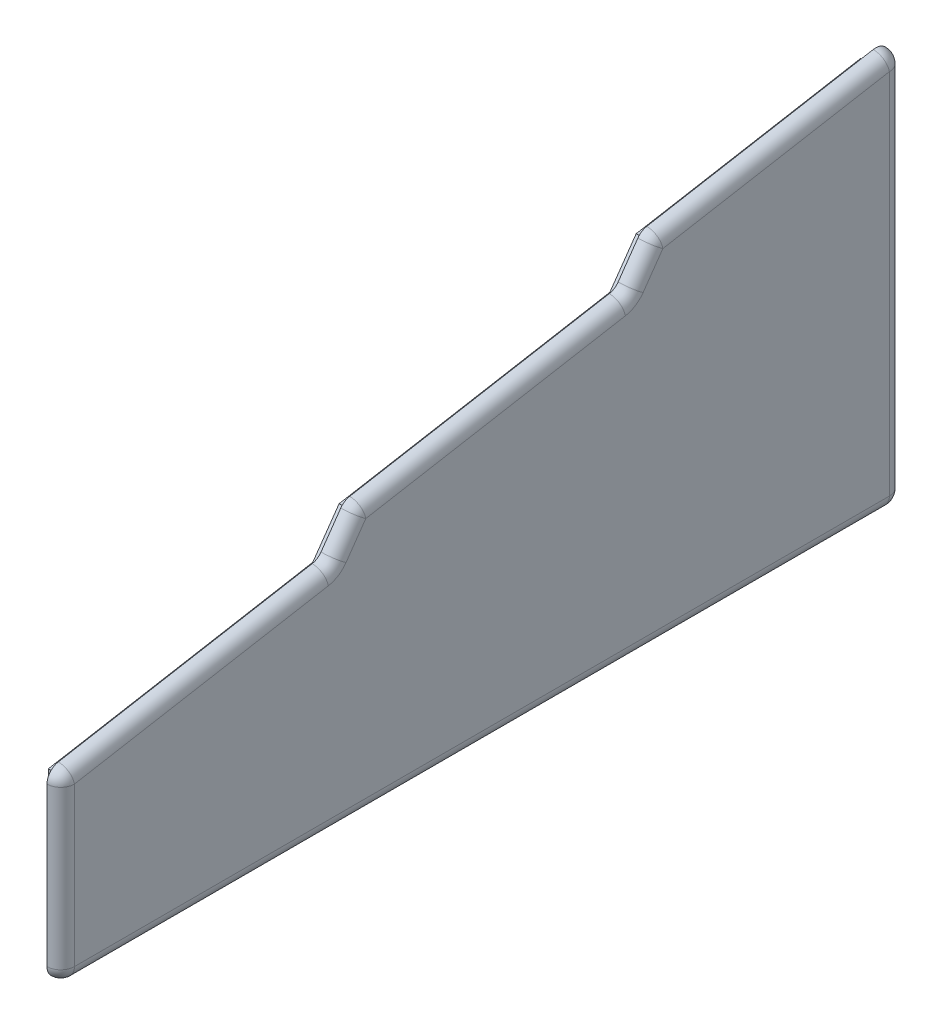
ISO-10303-21;
HEADER;
FILE_DESCRIPTION(('STEP AP214'),'2;1');
FILE_NAME('part.step','',(''),(''),'','','');
FILE_SCHEMA(('AUTOMOTIVE_DESIGN { 1 0 10303 214 1 1 1 1 }'));
ENDSEC;
DATA;
#1=APPLICATION_CONTEXT('core data for automotive mechanical design processes');
#2=APPLICATION_PROTOCOL_DEFINITION('international standard','automotive_design',2000,#1);
#3=PRODUCT_CONTEXT('',#1,'mechanical');
#4=PRODUCT('Part','Part','',(#3));
#5=PRODUCT_RELATED_PRODUCT_CATEGORY('part','',(#4));
#6=PRODUCT_DEFINITION_FORMATION('','',#4);
#7=PRODUCT_DEFINITION_CONTEXT('part definition',#1,'design');
#8=PRODUCT_DEFINITION('design','',#6,#7);
#9=PRODUCT_DEFINITION_SHAPE('','',#8);
#10=(LENGTH_UNIT() NAMED_UNIT(*) SI_UNIT(.MILLI.,.METRE.));
#11=(NAMED_UNIT(*) PLANE_ANGLE_UNIT() SI_UNIT($,.RADIAN.));
#12=(NAMED_UNIT(*) SI_UNIT($,.STERADIAN.) SOLID_ANGLE_UNIT());
#13=UNCERTAINTY_MEASURE_WITH_UNIT(LENGTH_MEASURE(1.E-05),#10,'distance_accuracy_value','');
#14=(GEOMETRIC_REPRESENTATION_CONTEXT(3) GLOBAL_UNCERTAINTY_ASSIGNED_CONTEXT((#13)) GLOBAL_UNIT_ASSIGNED_CONTEXT((#10,
#11,#12)) REPRESENTATION_CONTEXT('',''));
#15=CARTESIAN_POINT('',(0.,0.,0.));
#16=DIRECTION('',(0.,0.,1.));
#17=DIRECTION('',(1.,0.,0.));
#18=AXIS2_PLACEMENT_3D('',#15,#16,#17);
#19=CARTESIAN_POINT('',(-373.423184310713,0.,0.));
#20=DIRECTION('',(-1.,0.,0.));
#21=DIRECTION('',(0.,0.,-1.));
#22=AXIS2_PLACEMENT_3D('',#19,#20,#21);
#23=PLANE('',#22);
#24=DIRECTION('',(0.,0.,-1.));
#25=VECTOR('',#24,1.);
#26=CARTESIAN_POINT('',(-373.423184310713,-10.7880097999776,0.));
#27=LINE('',#26,#25);
#28=CARTESIAN_POINT('',(-373.423184310713,-10.7880097999776,139.976426469536));
#29=VERTEX_POINT('',#28);
#30=CARTESIAN_POINT('',(-373.423184310713,-10.7880097999776,-22.9293194874225));
#31=VERTEX_POINT('',#30);
#32=EDGE_CURVE('E262',#29,#31,#27,.T.);
#33=ORIENTED_EDGE('',*,*,#32,.F.);
#34=DIRECTION('',(0.,-1.,0.));
#35=VECTOR('',#34,1.);
#36=CARTESIAN_POINT('',(-373.423184310713,13.4732113382659,139.976426469536));
#37=LINE('',#36,#35);
#38=CARTESIAN_POINT('',(-373.423184310713,6.08268449513496,139.976426469536));
#39=VERTEX_POINT('',#38);
#40=EDGE_CURVE('E251',#39,#29,#37,.T.);
#41=ORIENTED_EDGE('',*,*,#40,.F.);
#42=DIRECTION('',(0.,-0.707106781186542,-0.707106781186553));
#43=VECTOR('',#42,1.);
#44=CARTESIAN_POINT('',(-373.423184310713,-66.9468709872003,66.9468709871994));
#45=LINE('',#44,#43);
#46=CARTESIAN_POINT('',(-373.423184310713,13.2362542687344,147.129996243135));
#47=VERTEX_POINT('',#46);
#48=EDGE_CURVE('E258',#47,#39,#45,.T.);
#49=ORIENTED_EDGE('',*,*,#48,.F.);
#50=DIRECTION('',(0.,-1.,0.));
#51=VECTOR('',#50,1.);
#52=CARTESIAN_POINT('',(-373.423184310713,0.,147.129996243135));
#53=LINE('',#52,#51);
#54=CARTESIAN_POINT('',(-373.423184310713,23.1429614171373,147.129996243135));
#55=VERTEX_POINT('',#54);
#56=EDGE_CURVE('E288',#55,#47,#53,.T.);
#57=ORIENTED_EDGE('',*,*,#56,.F.);
#58=DIRECTION('',(0.,-0.173648177666931,0.984807753012208));
#59=VECTOR('',#58,1.);
#60=CARTESIAN_POINT('',(-373.423184310713,47.6058269432683,8.39419172903622));
#61=LINE('',#60,#59);
#62=CARTESIAN_POINT('',(-373.423184310713,33.3183757949922,89.4223536749301));
#63=VERTEX_POINT('',#62);
#64=EDGE_CURVE('E284',#63,#55,#61,.T.);
#65=ORIENTED_EDGE('',*,*,#64,.F.);
#66=DIRECTION('',(0.,-0.819152044288993,0.573576436351044));
#67=VECTOR('',#66,1.);
#68=CARTESIAN_POINT('',(-373.423184310713,52.9761730059248,75.6578158832374));
#69=LINE('',#68,#67);
#70=CARTESIAN_POINT('',(-373.423184310713,41.5098962378821,83.6865893114197));
#71=VERTEX_POINT('',#70);
#72=EDGE_CURVE('E281',#71,#63,#69,.T.);
#73=ORIENTED_EDGE('',*,*,#72,.F.);
#74=DIRECTION('',(0.,-0.173648177666931,0.984807753012208));
#75=VECTOR('',#74,1.);
#76=CARTESIAN_POINT('',(-373.423184310713,54.5694693464685,9.62206976872595));
#77=LINE('',#76,#75);
#78=CARTESIAN_POINT('',(-373.423184310713,51.928786897898,24.5981241306872));
#79=VERTEX_POINT('',#78);
#80=EDGE_CURVE('E277',#79,#71,#77,.T.);
#81=ORIENTED_EDGE('',*,*,#80,.F.);
#82=DIRECTION('',(0.,-0.819152044288993,0.573576436351044));
#83=VECTOR('',#82,1.);
#84=CARTESIAN_POINT('',(-373.423184310713,28.6413857455665,40.9041379628631));
#85=LINE('',#84,#83);
#86=CARTESIAN_POINT('',(-373.423184310713,60.120307340788,18.8623597671767));
#87=VERTEX_POINT('',#86);
#88=EDGE_CURVE('E274',#87,#79,#85,.T.);
#89=ORIENTED_EDGE('',*,*,#88,.F.);
#90=DIRECTION('',(0.,-0.173648177666931,0.984807753012208));
#91=VECTOR('',#90,1.);
#92=CARTESIAN_POINT('',(-373.423184310713,61.5331117496687,10.8499478084157));
#93=LINE('',#92,#91);
#94=CARTESIAN_POINT('',(-373.423184310713,68.7506753219542,-30.082889261022));
#95=VERTEX_POINT('',#94);
#96=EDGE_CURVE('E271',#95,#87,#93,.T.);
#97=ORIENTED_EDGE('',*,*,#96,.F.);
#98=DIRECTION('',(0.,1.,0.));
#99=VECTOR('',#98,1.);
#100=CARTESIAN_POINT('',(-373.423184310713,0.,-30.082889261022));
#101=LINE('',#100,#99);
#102=CARTESIAN_POINT('',(-373.423184310713,13.2362542687345,-30.082889261022));
#103=VERTEX_POINT('',#102);
#104=EDGE_CURVE('E268',#103,#95,#101,.T.);
#105=ORIENTED_EDGE('',*,*,#104,.F.);
#106=DIRECTION('',(0.,0.707106781186551,-0.707106781186544));
#107=VECTOR('',#106,1.);
#108=CARTESIAN_POINT('',(-373.423184310713,-8.42331749614381,-8.42331749614389));
#109=LINE('',#108,#107);
#110=CARTESIAN_POINT('',(-373.423184310713,6.08268449513488,-22.9293194874225));
#111=VERTEX_POINT('',#110);
#112=EDGE_CURVE('E266',#111,#103,#109,.T.);
#113=ORIENTED_EDGE('',*,*,#112,.F.);
#114=DIRECTION('',(0.,-1.,0.));
#115=VECTOR('',#114,1.);
#116=CARTESIAN_POINT('',(-373.423184310713,13.4732113382659,-22.9293194874225));
#117=LINE('',#116,#115);
#118=EDGE_CURVE('E229',#111,#31,#117,.T.);
#119=ORIENTED_EDGE('',*,*,#118,.T.);
#120=EDGE_LOOP('',(#33,#41,#49,#57,#65,#73,#81,#89,#97,#105,#113,#119));
#121=FACE_BOUND('',#120,.T.);
#122=ADVANCED_FACE('F41',(#121),#23,.T.);
#123=CARTESIAN_POINT('',(-370.423184310713,69.1082013997325,-30.382889261022));
#124=DIRECTION('',(1.,0.,0.));
#125=DIRECTION('',(0.,0.,1.));
#126=AXIS2_PLACEMENT_3D('',#123,#124,#125);
#127=PLANE('',#126);
#128=CARTESIAN_POINT('',(-370.423184310713,-11.0880097999776,147.429996243135));
#129=DIRECTION('',(-1.,0.,0.));
#130=DIRECTION('',(0.,0.,1.));
#131=AXIS2_PLACEMENT_3D('',#128,#129,#130);
#132=CIRCLE('',#131,3.);
#133=CARTESIAN_POINT('',(-370.423184310713,-14.0880097999776,147.429996243135));
#134=VERTEX_POINT('',#133);
#135=CARTESIAN_POINT('',(-370.423184310713,-11.0880097999776,150.429996243135));
#136=VERTEX_POINT('',#135);
#137=EDGE_CURVE('E349',#134,#136,#132,.T.);
#138=ORIENTED_EDGE('',*,*,#137,.T.);
#139=DIRECTION('',(0.,1.,0.));
#140=VECTOR('',#139,1.);
#141=CARTESIAN_POINT('',(-370.423184310713,-4.08800979997756,150.429996243135));
#142=LINE('',#141,#140);
#143=CARTESIAN_POINT('',(-370.423184310713,23.3946913064905,150.429996243135));
#144=VERTEX_POINT('',#143);
#145=EDGE_CURVE('E352',#136,#144,#142,.T.);
#146=ORIENTED_EDGE('',*,*,#145,.T.);
#147=CARTESIAN_POINT('',(-370.423184310713,23.3946913064905,147.429996243135));
#148=DIRECTION('',(-1.,0.,0.));
#149=DIRECTION('',(0.,0.,1.));
#150=AXIS2_PLACEMENT_3D('',#147,#148,#149);
#151=CIRCLE('',#150,3.);
#152=CARTESIAN_POINT('',(-370.423184310713,26.3491145655271,147.950940776136));
#153=VERTEX_POINT('',#152);
#154=EDGE_CURVE('E356',#144,#153,#151,.T.);
#155=ORIENTED_EDGE('',*,*,#154,.T.);
#156=DIRECTION('',(0.,0.17364817766693,-0.984807753012208));
#157=VECTOR('',#156,1.);
#158=CARTESIAN_POINT('',(-370.423184310713,26.3491145655271,147.950940776136));
#159=LINE('',#158,#157);
#160=CARTESIAN_POINT('',(-370.423184310713,36.1150985692251,92.5652932452863));
#161=VERTEX_POINT('',#160);
#162=EDGE_CURVE('E360',#153,#161,#159,.T.);
#163=ORIENTED_EDGE('',*,*,#162,.T.);
#164=CARTESIAN_POINT('',(-370.423184310713,39.0695218282617,93.0862377782871));
#165=DIRECTION('',(-1.,0.,0.));
#166=DIRECTION('',(0.,0.,1.));
#167=AXIS2_PLACEMENT_3D('',#164,#165,#166);
#168=CIRCLE('',#167,2.99999999999999);
#169=CARTESIAN_POINT('',(-370.423184310713,37.3487925192086,90.6287816454201));
#170=VERTEX_POINT('',#169);
#171=EDGE_CURVE('E364',#170,#161,#168,.T.);
#172=ORIENTED_EDGE('',*,*,#171,.F.);
#173=DIRECTION('',(0.,0.819152044288993,-0.573576436351044));
#174=VECTOR('',#173,1.);
#175=CARTESIAN_POINT('',(-370.423184310713,37.3487925192086,90.6287816454201));
#176=LINE('',#175,#174);
#177=CARTESIAN_POINT('',(-370.423184310713,43.5044896437576,86.3185161158751));
#178=VERTEX_POINT('',#177);
#179=EDGE_CURVE('E367',#170,#178,#176,.T.);
#180=ORIENTED_EDGE('',*,*,#179,.T.);
#181=CARTESIAN_POINT('',(-370.423184310713,41.7837603347045,83.8610599830081));
#182=DIRECTION('',(-1.,0.,0.));
#183=DIRECTION('',(0.,0.,1.));
#184=AXIS2_PLACEMENT_3D('',#181,#182,#183);
#185=CIRCLE('',#184,3.00000000000001);
#186=CARTESIAN_POINT('',(-370.423184310713,44.7381835937411,84.3820045160089));
#187=VERTEX_POINT('',#186);
#188=EDGE_CURVE('E370',#178,#187,#185,.T.);
#189=ORIENTED_EDGE('',*,*,#188,.T.);
#190=DIRECTION('',(0.,0.173648177666931,-0.984807753012208));
#191=VECTOR('',#190,1.);
#192=CARTESIAN_POINT('',(-370.423184310713,44.7381835937411,84.3820045160089));
#193=LINE('',#192,#191);
#194=CARTESIAN_POINT('',(-370.423184310713,54.7255096721309,27.7410637010434));
#195=VERTEX_POINT('',#194);
#196=EDGE_CURVE('E373',#187,#195,#193,.T.);
#197=ORIENTED_EDGE('',*,*,#196,.T.);
#198=CARTESIAN_POINT('',(-370.423184310713,57.6799329311675,28.2620082340442));
#199=DIRECTION('',(-1.,0.,0.));
#200=DIRECTION('',(0.,0.,1.));
#201=AXIS2_PLACEMENT_3D('',#198,#199,#200);
#202=CIRCLE('',#201,3.);
#203=CARTESIAN_POINT('',(-370.423184310713,55.9592036221144,25.8045521011772));
#204=VERTEX_POINT('',#203);
#205=EDGE_CURVE('E377',#204,#195,#202,.T.);
#206=ORIENTED_EDGE('',*,*,#205,.F.);
#207=DIRECTION('',(0.,0.819152044288995,-0.573576436351042));
#208=VECTOR('',#207,1.);
#209=CARTESIAN_POINT('',(-370.423184310713,55.9592036221144,25.8045521011772));
#210=LINE('',#209,#208);
#211=CARTESIAN_POINT('',(-370.423184310713,62.1149007466635,21.4942865716322));
#212=VERTEX_POINT('',#211);
#213=EDGE_CURVE('E381',#204,#212,#210,.T.);
#214=ORIENTED_EDGE('',*,*,#213,.T.);
#215=CARTESIAN_POINT('',(-370.423184310713,60.3941714376103,19.0368304387652));
#216=DIRECTION('',(-1.,0.,0.));
#217=DIRECTION('',(0.,0.,1.));
#218=AXIS2_PLACEMENT_3D('',#215,#216,#217);
#219=CIRCLE('',#218,3.);
#220=CARTESIAN_POINT('',(-370.423184310713,63.348594696647,19.557774971766));
#221=VERTEX_POINT('',#220);
#222=EDGE_CURVE('E384',#212,#221,#219,.T.);
#223=ORIENTED_EDGE('',*,*,#222,.T.);
#224=DIRECTION('',(0.,0.173648177666931,-0.984807753012208));
#225=VECTOR('',#224,1.);
#226=CARTESIAN_POINT('',(-370.423184310713,63.348594696647,19.557774971766));
#227=LINE('',#226,#225);
#228=CARTESIAN_POINT('',(-370.423184310713,72.0626246587691,-29.8619447280211));
#229=VERTEX_POINT('',#228);
#230=EDGE_CURVE('E387',#221,#229,#227,.T.);
#231=ORIENTED_EDGE('',*,*,#230,.T.);
#232=CARTESIAN_POINT('',(-370.423184310713,69.1082013997325,-30.382889261022));
#233=DIRECTION('',(-1.,0.,0.));
#234=DIRECTION('',(0.,0.,1.));
#235=AXIS2_PLACEMENT_3D('',#232,#233,#234);
#236=CIRCLE('',#235,3.);
#237=CARTESIAN_POINT('',(-370.423184310713,69.1082013997325,-33.382889261022));
#238=VERTEX_POINT('',#237);
#239=EDGE_CURVE('E336',#229,#238,#236,.T.);
#240=ORIENTED_EDGE('',*,*,#239,.T.);
#241=DIRECTION('',(0.,-1.,0.));
#242=VECTOR('',#241,1.);
#243=CARTESIAN_POINT('',(-370.423184310713,-4.08800979997752,-33.382889261022));
#244=LINE('',#243,#242);
#245=CARTESIAN_POINT('',(-370.423184310713,-11.0880097999776,-33.382889261022));
#246=VERTEX_POINT('',#245);
#247=EDGE_CURVE('E339',#238,#246,#244,.T.);
#248=ORIENTED_EDGE('',*,*,#247,.T.);
#249=CARTESIAN_POINT('',(-370.423184310713,-11.0880097999776,-30.382889261022));
#250=DIRECTION('',(-1.,0.,0.));
#251=DIRECTION('',(0.,0.,1.));
#252=AXIS2_PLACEMENT_3D('',#249,#250,#251);
#253=CIRCLE('',#252,3.);
#254=CARTESIAN_POINT('',(-370.423184310713,-14.0880097999776,-30.382889261022));
#255=VERTEX_POINT('',#254);
#256=EDGE_CURVE('E342',#246,#255,#253,.T.);
#257=ORIENTED_EDGE('',*,*,#256,.T.);
#258=DIRECTION('',(0.,0.,1.));
#259=VECTOR('',#258,1.);
#260=CARTESIAN_POINT('',(-370.423184310713,-14.0880097999776,-30.382889261022));
#261=LINE('',#260,#259);
#262=EDGE_CURVE('E345',#255,#134,#261,.T.);
#263=ORIENTED_EDGE('',*,*,#262,.T.);
#264=EDGE_LOOP('',(#138,#146,#155,#163,#172,#180,#189,#197,#206,#214,#223,#231,#240,#248,#257,#263));
#265=FACE_BOUND('',#264,.T.);
#266=DIRECTION('',(0.,0.,-1.));
#267=VECTOR('',#266,1.);
#268=CARTESIAN_POINT('',(-370.423184310713,-10.7880097999776,0.));
#269=LINE('',#268,#267);
#270=CARTESIAN_POINT('',(-370.423184310713,-10.7880097999776,142.329996243135));
#271=VERTEX_POINT('',#270);
#272=CARTESIAN_POINT('',(-370.423184310713,-10.7880097999776,-25.282889261022));
#273=VERTEX_POINT('',#272);
#274=EDGE_CURVE('E240',#271,#273,#269,.T.);
#275=ORIENTED_EDGE('',*,*,#274,.T.);
#276=DIRECTION('',(0.,-1.,0.));
#277=VECTOR('',#276,1.);
#278=CARTESIAN_POINT('',(-370.423184310713,13.4732113382659,-25.282889261022));
#279=LINE('',#278,#277);
#280=CARTESIAN_POINT('',(-370.423184310713,8.43625426873448,-25.282889261022));
#281=VERTEX_POINT('',#280);
#282=EDGE_CURVE('E226',#281,#273,#279,.T.);
#283=ORIENTED_EDGE('',*,*,#282,.F.);
#284=DIRECTION('',(0.,0.707106781186551,-0.707106781186544));
#285=VECTOR('',#284,1.);
#286=CARTESIAN_POINT('',(-370.423184310713,-8.42331749614381,-8.42331749614389));
#287=LINE('',#286,#285);
#288=CARTESIAN_POINT('',(-370.423184310713,13.2362542687345,-30.082889261022));
#289=VERTEX_POINT('',#288);
#290=EDGE_CURVE('E235',#281,#289,#287,.T.);
#291=ORIENTED_EDGE('',*,*,#290,.T.);
#292=DIRECTION('',(0.,1.,0.));
#293=VECTOR('',#292,1.);
#294=CARTESIAN_POINT('',(-370.423184310713,0.,-30.082889261022));
#295=LINE('',#294,#293);
#296=CARTESIAN_POINT('',(-370.423184310713,68.7506753219542,-30.082889261022));
#297=VERTEX_POINT('',#296);
#298=EDGE_CURVE('E239',#289,#297,#295,.T.);
#299=ORIENTED_EDGE('',*,*,#298,.T.);
#300=DIRECTION('',(0.,-0.173648177666931,0.984807753012208));
#301=VECTOR('',#300,1.);
#302=CARTESIAN_POINT('',(-370.423184310713,61.5331117496687,10.8499478084157));
#303=LINE('',#302,#301);
#304=CARTESIAN_POINT('',(-370.423184310713,60.120307340788,18.8623597671767));
#305=VERTEX_POINT('',#304);
#306=EDGE_CURVE('E299',#297,#305,#303,.T.);
#307=ORIENTED_EDGE('',*,*,#306,.T.);
#308=DIRECTION('',(0.,-0.819152044288993,0.573576436351044));
#309=VECTOR('',#308,1.);
#310=CARTESIAN_POINT('',(-370.423184310713,28.6413857455665,40.9041379628631));
#311=LINE('',#310,#309);
#312=CARTESIAN_POINT('',(-370.423184310713,51.928786897898,24.5981241306872));
#313=VERTEX_POINT('',#312);
#314=EDGE_CURVE('E302',#305,#313,#311,.T.);
#315=ORIENTED_EDGE('',*,*,#314,.T.);
#316=DIRECTION('',(0.,-0.173648177666931,0.984807753012208));
#317=VECTOR('',#316,1.);
#318=CARTESIAN_POINT('',(-370.423184310713,54.5694693464685,9.62206976872595));
#319=LINE('',#318,#317);
#320=CARTESIAN_POINT('',(-370.423184310713,41.5098962378821,83.6865893114197));
#321=VERTEX_POINT('',#320);
#322=EDGE_CURVE('E305',#313,#321,#319,.T.);
#323=ORIENTED_EDGE('',*,*,#322,.T.);
#324=DIRECTION('',(0.,-0.819152044288993,0.573576436351044));
#325=VECTOR('',#324,1.);
#326=CARTESIAN_POINT('',(-370.423184310713,52.9761730059248,75.6578158832374));
#327=LINE('',#326,#325);
#328=CARTESIAN_POINT('',(-370.423184310713,33.3183757949922,89.4223536749301));
#329=VERTEX_POINT('',#328);
#330=EDGE_CURVE('E309',#321,#329,#327,.T.);
#331=ORIENTED_EDGE('',*,*,#330,.T.);
#332=DIRECTION('',(0.,-0.173648177666931,0.984807753012208));
#333=VECTOR('',#332,1.);
#334=CARTESIAN_POINT('',(-370.423184310713,47.6058269432683,8.39419172903622));
#335=LINE('',#334,#333);
#336=CARTESIAN_POINT('',(-370.423184310713,23.1429614171373,147.129996243135));
#337=VERTEX_POINT('',#336);
#338=EDGE_CURVE('E312',#329,#337,#335,.T.);
#339=ORIENTED_EDGE('',*,*,#338,.T.);
#340=DIRECTION('',(0.,-1.,0.));
#341=VECTOR('',#340,1.);
#342=CARTESIAN_POINT('',(-370.423184310713,0.,147.129996243135));
#343=LINE('',#342,#341);
#344=CARTESIAN_POINT('',(-370.423184310713,13.2362542687344,147.129996243135));
#345=VERTEX_POINT('',#344);
#346=EDGE_CURVE('E263',#337,#345,#343,.T.);
#347=ORIENTED_EDGE('',*,*,#346,.T.);
#348=DIRECTION('',(0.,-0.707106781186542,-0.707106781186553));
#349=VECTOR('',#348,1.);
#350=CARTESIAN_POINT('',(-370.423184310713,-66.9468709872003,66.9468709871994));
#351=LINE('',#350,#349);
#352=CARTESIAN_POINT('',(-370.423184310713,8.43625426873438,142.329996243135));
#353=VERTEX_POINT('',#352);
#354=EDGE_CURVE('E257',#345,#353,#351,.T.);
#355=ORIENTED_EDGE('',*,*,#354,.T.);
#356=DIRECTION('',(0.,-1.,0.));
#357=VECTOR('',#356,1.);
#358=CARTESIAN_POINT('',(-370.423184310713,13.4732113382659,142.329996243135));
#359=LINE('',#358,#357);
#360=EDGE_CURVE('E231',#353,#271,#359,.T.);
#361=ORIENTED_EDGE('',*,*,#360,.T.);
#362=EDGE_LOOP('',(#275,#283,#291,#299,#307,#315,#323,#331,#339,#347,#355,#361));
#363=FACE_BOUND('',#362,.T.);
#364=ADVANCED_FACE('F242',(#265,#363),#127,.F.);
#365=CARTESIAN_POINT('',(-367.423184310713,69.1082013997325,-30.382889261022));
#366=DIRECTION('',(1.,0.,0.));
#367=DIRECTION('',(0.,0.,1.));
#368=AXIS2_PLACEMENT_3D('',#365,#366,#367);
#369=PLANE('',#368);
#370=DIRECTION('',(0.,0.819152044288995,-0.573576436351042));
#371=VECTOR('',#370,1.);
#372=CARTESIAN_POINT('',(-367.423184310713,60.3941714376103,19.0368304387652));
#373=LINE('',#372,#371);
#374=CARTESIAN_POINT('',(-367.423184310713,54.2384743130613,23.3470959683102));
#375=VERTEX_POINT('',#374);
#376=CARTESIAN_POINT('',(-367.423184310713,60.3941714376103,19.0368304387652));
#377=VERTEX_POINT('',#376);
#378=EDGE_CURVE('E50',#375,#377,#373,.T.);
#379=ORIENTED_EDGE('',*,*,#378,.F.);
#380=CARTESIAN_POINT('',(-367.423184310713,57.6799329311675,28.2620082340442));
#381=DIRECTION('',(-1.,0.,0.));
#382=DIRECTION('',(0.,0.,1.));
#383=AXIS2_PLACEMENT_3D('',#380,#381,#382);
#384=CIRCLE('',#383,6.);
#385=CARTESIAN_POINT('',(-367.423184310713,51.7710864130943,27.2201191680426));
#386=VERTEX_POINT('',#385);
#387=EDGE_CURVE('E415',#386,#375,#384,.F.);
#388=ORIENTED_EDGE('',*,*,#387,.F.);
#389=DIRECTION('',(0.,0.173648177666931,-0.984807753012208));
#390=VECTOR('',#389,1.);
#391=CARTESIAN_POINT('',(-367.423184310713,51.7710864130943,27.2201191680426));
#392=LINE('',#391,#390);
#393=CARTESIAN_POINT('',(-367.423184310713,41.7837603347045,83.8610599830081));
#394=VERTEX_POINT('',#393);
#395=EDGE_CURVE('E411',#394,#386,#392,.T.);
#396=ORIENTED_EDGE('',*,*,#395,.F.);
#397=DIRECTION('',(0.,0.819152044288993,-0.573576436351044));
#398=VECTOR('',#397,1.);
#399=CARTESIAN_POINT('',(-367.423184310713,41.7837603347045,83.8610599830081));
#400=LINE('',#399,#398);
#401=CARTESIAN_POINT('',(-367.423184310713,35.6280632101555,88.1713255125532));
#402=VERTEX_POINT('',#401);
#403=EDGE_CURVE('E408',#402,#394,#400,.T.);
#404=ORIENTED_EDGE('',*,*,#403,.F.);
#405=CARTESIAN_POINT('',(-367.423184310713,39.0695218282617,93.0862377782871));
#406=DIRECTION('',(-1.,0.,0.));
#407=DIRECTION('',(0.,0.,1.));
#408=AXIS2_PLACEMENT_3D('',#405,#406,#407);
#409=CIRCLE('',#408,5.99999999999999);
#410=CARTESIAN_POINT('',(-367.423184310713,33.1606753101885,92.0443487122855));
#411=VERTEX_POINT('',#410);
#412=EDGE_CURVE('E405',#411,#402,#409,.F.);
#413=ORIENTED_EDGE('',*,*,#412,.F.);
#414=DIRECTION('',(0.,0.17364817766693,-0.984807753012208));
#415=VECTOR('',#414,1.);
#416=CARTESIAN_POINT('',(-367.423184310713,33.1606753101885,92.0443487122855));
#417=LINE('',#416,#415);
#418=CARTESIAN_POINT('',(-367.423184310713,23.3946913064905,147.429996243135));
#419=VERTEX_POINT('',#418);
#420=EDGE_CURVE('E401',#419,#411,#417,.T.);
#421=ORIENTED_EDGE('',*,*,#420,.F.);
#422=DIRECTION('',(0.,1.,0.));
#423=VECTOR('',#422,1.);
#424=CARTESIAN_POINT('',(-367.423184310713,23.3946913064905,147.429996243135));
#425=LINE('',#424,#423);
#426=CARTESIAN_POINT('',(-367.423184310713,-11.0880097999776,147.429996243135));
#427=VERTEX_POINT('',#426);
#428=EDGE_CURVE('E397',#427,#419,#425,.T.);
#429=ORIENTED_EDGE('',*,*,#428,.F.);
#430=DIRECTION('',(0.,0.,1.));
#431=VECTOR('',#430,1.);
#432=CARTESIAN_POINT('',(-367.423184310713,-11.0880097999776,147.429996243135));
#433=LINE('',#432,#431);
#434=CARTESIAN_POINT('',(-367.423184310713,-11.0880097999776,-30.382889261022));
#435=VERTEX_POINT('',#434);
#436=EDGE_CURVE('E393',#435,#427,#433,.T.);
#437=ORIENTED_EDGE('',*,*,#436,.F.);
#438=DIRECTION('',(0.,-1.,0.));
#439=VECTOR('',#438,1.);
#440=CARTESIAN_POINT('',(-367.423184310713,-11.0880097999776,-30.382889261022));
#441=LINE('',#440,#439);
#442=CARTESIAN_POINT('',(-367.423184310713,69.1082013997325,-30.382889261022));
#443=VERTEX_POINT('',#442);
#444=EDGE_CURVE('E390',#443,#435,#441,.T.);
#445=ORIENTED_EDGE('',*,*,#444,.F.);
#446=DIRECTION('',(0.,0.173648177666931,-0.984807753012208));
#447=VECTOR('',#446,1.);
#448=CARTESIAN_POINT('',(-367.423184310713,69.1082013997325,-30.3828892610219));
#449=LINE('',#448,#447);
#450=EDGE_CURVE('E11',#377,#443,#449,.T.);
#451=ORIENTED_EDGE('',*,*,#450,.F.);
#452=EDGE_LOOP('',(#379,#388,#396,#404,#413,#421,#429,#437,#445,#451));
#453=FACE_BOUND('',#452,.T.);
#454=ADVANCED_FACE('F475',(#453),#369,.T.);
#455=CARTESIAN_POINT('',(-370.423184310713,55.1809165933319,-32.8386453404014));
#456=DIRECTION('',(0.,-0.17364817766693,0.984807753012208));
#457=DIRECTION('',(0.,-0.984807753012208,-0.17364817766693));
#458=AXIS2_PLACEMENT_3D('',#455,#456,#457);
#459=CYLINDRICAL_SURFACE('',#458,3.);
#460=CARTESIAN_POINT('',(-370.423184310713,23.3946913064905,147.429996243135));
#461=DIRECTION('',(0.,0.173648177666926,-0.984807753012209));
#462=DIRECTION('',(0.,-0.984807753012209,-0.173648177666926));
#463=AXIS2_PLACEMENT_3D('',#460,#461,#462);
#464=CIRCLE('',#463,3.);
#465=EDGE_CURVE('E453',#153,#419,#464,.T.);
#466=ORIENTED_EDGE('',*,*,#465,.T.);
#467=ORIENTED_EDGE('',*,*,#420,.T.);
#468=CARTESIAN_POINT('',(-370.423184310713,33.1606753101885,92.0443487122855));
#469=DIRECTION('',(0.,-0.173648177666931,0.984807753012208));
#470=DIRECTION('',(0.,0.984807753012208,0.173648177666931));
#471=AXIS2_PLACEMENT_3D('',#468,#469,#470);
#472=CIRCLE('',#471,3.);
#473=EDGE_CURVE('E45',#411,#161,#472,.T.);
#474=ORIENTED_EDGE('',*,*,#473,.T.);
#475=ORIENTED_EDGE('',*,*,#162,.F.);
#476=EDGE_LOOP('',(#466,#467,#474,#475));
#477=FACE_BOUND('',#476,.T.);
#478=ADVANCED_FACE('F43',(#477),#459,.T.);
#479=CARTESIAN_POINT('',(-370.423184310713,39.0695218282617,93.0862377782871));
#480=DIRECTION('',(1.,0.,0.));
#481=DIRECTION('',(0.,0.,1.));
#482=AXIS2_PLACEMENT_3D('',#479,#480,#481);
#483=TOROIDAL_SURFACE('',#482,5.99999999999999,3.);
#484=ORIENTED_EDGE('',*,*,#473,.F.);
#485=ORIENTED_EDGE('',*,*,#412,.T.);
#486=CARTESIAN_POINT('',(-370.423184310713,35.6280632101555,88.1713255125532));
#487=DIRECTION('',(0.,-0.819152044288993,0.573576436351045));
#488=DIRECTION('',(0.,0.573576436351045,0.819152044288993));
#489=AXIS2_PLACEMENT_3D('',#486,#487,#488);
#490=CIRCLE('',#489,3.);
#491=EDGE_CURVE('E452',#402,#170,#490,.T.);
#492=ORIENTED_EDGE('',*,*,#491,.T.);
#493=ORIENTED_EDGE('',*,*,#171,.T.);
#494=EDGE_LOOP('',(#484,#485,#492,#493));
#495=FACE_BOUND('',#494,.T.);
#496=ADVANCED_FACE('F462',(#495),#483,.T.);
#497=CARTESIAN_POINT('',(-370.423184310713,23.3946913064905,147.429996243135));
#498=DIRECTION('',(1.,0.,0.));
#499=DIRECTION('',(0.,0.,1.));
#500=AXIS2_PLACEMENT_3D('',#497,#498,#499);
#501=SPHERICAL_SURFACE('',#500,3.);
#502=ORIENTED_EDGE('',*,*,#154,.F.);
#503=CARTESIAN_POINT('',(-370.423184310713,23.3946913064905,147.429996243135));
#504=DIRECTION('',(0.,1.,0.));
#505=DIRECTION('',(0.,0.,-1.));
#506=AXIS2_PLACEMENT_3D('',#503,#504,#505);
#507=CIRCLE('',#506,3.);
#508=EDGE_CURVE('E449',#144,#419,#507,.T.);
#509=ORIENTED_EDGE('',*,*,#508,.T.);
#510=ORIENTED_EDGE('',*,*,#465,.F.);
#511=EDGE_LOOP('',(#502,#509,#510));
#512=FACE_BOUND('',#511,.T.);
#513=ADVANCED_FACE('F468',(#512),#501,.T.);
#514=CARTESIAN_POINT('',(-370.423184310713,113.795833528923,33.437663490307));
#515=DIRECTION('',(0.,-0.819152044288993,0.573576436351044));
#516=DIRECTION('',(0.,-0.573576436351044,-0.819152044288993));
#517=AXIS2_PLACEMENT_3D('',#514,#515,#516);
#518=CYLINDRICAL_SURFACE('',#517,3.);
#519=ORIENTED_EDGE('',*,*,#491,.F.);
#520=ORIENTED_EDGE('',*,*,#403,.T.);
#521=CARTESIAN_POINT('',(-370.423184310713,41.7837603347045,83.8610599830081));
#522=DIRECTION('',(0.,-0.819152044288994,0.573576436351043));
#523=DIRECTION('',(0.,0.573576436351043,0.819152044288994));
#524=AXIS2_PLACEMENT_3D('',#521,#522,#523);
#525=CIRCLE('',#524,3.);
#526=EDGE_CURVE('E447',#394,#178,#525,.T.);
#527=ORIENTED_EDGE('',*,*,#526,.T.);
#528=ORIENTED_EDGE('',*,*,#179,.F.);
#529=EDGE_LOOP('',(#519,#520,#527,#528));
#530=FACE_BOUND('',#529,.T.);
#531=ADVANCED_FACE('F480',(#530),#518,.T.);
#532=CARTESIAN_POINT('',(-370.423184310713,69.1082013997323,147.429996243135));
#533=DIRECTION('',(0.,-1.,0.));
#534=DIRECTION('',(0.,0.,-1.));
#535=AXIS2_PLACEMENT_3D('',#532,#533,#534);
#536=CYLINDRICAL_SURFACE('',#535,3.);
#537=ORIENTED_EDGE('',*,*,#508,.F.);
#538=ORIENTED_EDGE('',*,*,#145,.F.);
#539=CARTESIAN_POINT('',(-370.423184310713,-11.0880097999776,147.429996243135));
#540=DIRECTION('',(0.,1.,0.));
#541=DIRECTION('',(0.,0.,-1.));
#542=AXIS2_PLACEMENT_3D('',#539,#540,#541);
#543=CIRCLE('',#542,3.);
#544=EDGE_CURVE('E444',#136,#427,#543,.T.);
#545=ORIENTED_EDGE('',*,*,#544,.T.);
#546=ORIENTED_EDGE('',*,*,#428,.T.);
#547=EDGE_LOOP('',(#537,#538,#545,#546));
#548=FACE_BOUND('',#547,.T.);
#549=ADVANCED_FACE('F470',(#548),#536,.T.);
#550=CARTESIAN_POINT('',(-370.423184310713,41.7837603347045,83.8610599830081));
#551=DIRECTION('',(1.,0.,0.));
#552=DIRECTION('',(0.,0.,1.));
#553=AXIS2_PLACEMENT_3D('',#550,#551,#552);
#554=SPHERICAL_SURFACE('',#553,3.);
#555=ORIENTED_EDGE('',*,*,#526,.F.);
#556=CARTESIAN_POINT('',(-370.423184310713,41.7837603347045,83.8610599830081));
#557=DIRECTION('',(0.,-0.173648177666935,0.984807753012207));
#558=DIRECTION('',(0.,0.984807753012207,0.173648177666935));
#559=AXIS2_PLACEMENT_3D('',#556,#557,#558);
#560=CIRCLE('',#559,3.);
#561=EDGE_CURVE('E442',#394,#187,#560,.T.);
#562=ORIENTED_EDGE('',*,*,#561,.T.);
#563=ORIENTED_EDGE('',*,*,#188,.F.);
#564=EDGE_LOOP('',(#555,#562,#563));
#565=FACE_BOUND('',#564,.T.);
#566=ADVANCED_FACE('F486',(#565),#554,.T.);
#567=CARTESIAN_POINT('',(-370.423184310713,-11.0880097999776,147.429996243135));
#568=DIRECTION('',(1.,0.,0.));
#569=DIRECTION('',(0.,0.,1.));
#570=AXIS2_PLACEMENT_3D('',#567,#568,#569);
#571=SPHERICAL_SURFACE('',#570,3.);
#572=ORIENTED_EDGE('',*,*,#137,.F.);
#573=CARTESIAN_POINT('',(-370.423184310713,-11.0880097999776,147.429996243135));
#574=DIRECTION('',(0.,0.,1.));
#575=DIRECTION('',(1.,0.,0.));
#576=AXIS2_PLACEMENT_3D('',#573,#574,#575);
#577=CIRCLE('',#576,3.);
#578=EDGE_CURVE('E440',#134,#427,#577,.T.);
#579=ORIENTED_EDGE('',*,*,#578,.T.);
#580=ORIENTED_EDGE('',*,*,#544,.F.);
#581=EDGE_LOOP('',(#572,#579,#580));
#582=FACE_BOUND('',#581,.T.);
#583=ADVANCED_FACE('F516',(#582),#571,.T.);
#584=CARTESIAN_POINT('',(-370.423184310713,62.1445589965323,-31.6107673007117));
#585=DIRECTION('',(0.,-0.173648177666931,0.984807753012208));
#586=DIRECTION('',(0.,-0.984807753012208,-0.173648177666931));
#587=AXIS2_PLACEMENT_3D('',#584,#585,#586);
#588=CYLINDRICAL_SURFACE('',#587,3.);
#589=ORIENTED_EDGE('',*,*,#561,.F.);
#590=ORIENTED_EDGE('',*,*,#395,.T.);
#591=CARTESIAN_POINT('',(-370.423184310713,51.7710864130943,27.2201191680426));
#592=DIRECTION('',(0.,-0.173648177666934,0.984807753012207));
#593=DIRECTION('',(0.,0.984807753012207,0.173648177666934));
#594=AXIS2_PLACEMENT_3D('',#591,#592,#593);
#595=CIRCLE('',#594,3.);
#596=EDGE_CURVE('E437',#386,#195,#595,.T.);
#597=ORIENTED_EDGE('',*,*,#596,.T.);
#598=ORIENTED_EDGE('',*,*,#196,.F.);
#599=EDGE_LOOP('',(#589,#590,#597,#598));
#600=FACE_BOUND('',#599,.T.);
#601=ADVANCED_FACE('F488',(#600),#588,.T.);
#602=CARTESIAN_POINT('',(-370.423184310713,-11.0880097999776,-30.3828892610219));
#603=DIRECTION('',(0.,0.,-1.));
#604=DIRECTION('',(0.,1.,0.));
#605=AXIS2_PLACEMENT_3D('',#602,#603,#604);
#606=CYLINDRICAL_SURFACE('',#605,3.);
#607=ORIENTED_EDGE('',*,*,#578,.F.);
#608=ORIENTED_EDGE('',*,*,#262,.F.);
#609=CARTESIAN_POINT('',(-370.423184310713,-11.0880097999776,-30.382889261022));
#610=DIRECTION('',(0.,0.,1.));
#611=DIRECTION('',(1.,0.,0.));
#612=AXIS2_PLACEMENT_3D('',#609,#610,#611);
#613=CIRCLE('',#612,3.);
#614=EDGE_CURVE('E434',#255,#435,#613,.T.);
#615=ORIENTED_EDGE('',*,*,#614,.T.);
#616=ORIENTED_EDGE('',*,*,#436,.T.);
#617=EDGE_LOOP('',(#607,#608,#615,#616));
#618=FACE_BOUND('',#617,.T.);
#619=ADVANCED_FACE('F517',(#618),#606,.T.);
#620=CARTESIAN_POINT('',(-370.423184310713,57.6799329311675,28.2620082340442));
#621=DIRECTION('',(1.,0.,0.));
#622=DIRECTION('',(0.,0.,1.));
#623=AXIS2_PLACEMENT_3D('',#620,#621,#622);
#624=TOROIDAL_SURFACE('',#623,6.,3.);
#625=ORIENTED_EDGE('',*,*,#596,.F.);
#626=ORIENTED_EDGE('',*,*,#387,.T.);
#627=CARTESIAN_POINT('',(-370.423184310713,54.2384743130613,23.3470959683102));
#628=DIRECTION('',(0.,-0.819152044288994,0.573576436351042));
#629=DIRECTION('',(0.,0.573576436351042,0.819152044288995));
#630=AXIS2_PLACEMENT_3D('',#627,#628,#629);
#631=CIRCLE('',#630,3.);
#632=EDGE_CURVE('E431',#375,#204,#631,.T.);
#633=ORIENTED_EDGE('',*,*,#632,.T.);
#634=ORIENTED_EDGE('',*,*,#205,.T.);
#635=EDGE_LOOP('',(#625,#626,#633,#634));
#636=FACE_BOUND('',#635,.T.);
#637=ADVANCED_FACE('F490',(#636),#624,.T.);
#638=CARTESIAN_POINT('',(-370.423184310713,-11.0880097999776,-30.382889261022));
#639=DIRECTION('',(1.,0.,0.));
#640=DIRECTION('',(0.,0.,1.));
#641=AXIS2_PLACEMENT_3D('',#638,#639,#640);
#642=SPHERICAL_SURFACE('',#641,3.);
#643=ORIENTED_EDGE('',*,*,#256,.F.);
#644=CARTESIAN_POINT('',(-370.423184310713,-11.0880097999776,-30.382889261022));
#645=DIRECTION('',(0.,-1.,0.));
#646=DIRECTION('',(0.,0.,1.));
#647=AXIS2_PLACEMENT_3D('',#644,#645,#646);
#648=CIRCLE('',#647,3.);
#649=EDGE_CURVE('E429',#246,#435,#648,.T.);
#650=ORIENTED_EDGE('',*,*,#649,.T.);
#651=ORIENTED_EDGE('',*,*,#614,.F.);
#652=EDGE_LOOP('',(#643,#650,#651));
#653=FACE_BOUND('',#652,.T.);
#654=ADVANCED_FACE('F511',(#653),#642,.T.);
#655=CARTESIAN_POINT('',(-370.423184310713,89.4610462685649,-1.31601443006709));
#656=DIRECTION('',(0.,-0.819152044288995,0.573576436351042));
#657=DIRECTION('',(0.,-0.573576436351042,-0.819152044288995));
#658=AXIS2_PLACEMENT_3D('',#655,#656,#657);
#659=CYLINDRICAL_SURFACE('',#658,3.);
#660=ORIENTED_EDGE('',*,*,#632,.F.);
#661=ORIENTED_EDGE('',*,*,#378,.T.);
#662=CARTESIAN_POINT('',(-370.423184310713,60.3941714376103,19.0368304387652));
#663=DIRECTION('',(0.,-0.819152044288994,0.573576436351044));
#664=DIRECTION('',(0.,0.573576436351044,0.819152044288993));
#665=AXIS2_PLACEMENT_3D('',#662,#663,#664);
#666=CIRCLE('',#665,3.);
#667=EDGE_CURVE('E427',#377,#212,#666,.T.);
#668=ORIENTED_EDGE('',*,*,#667,.T.);
#669=ORIENTED_EDGE('',*,*,#213,.F.);
#670=EDGE_LOOP('',(#660,#661,#668,#669));
#671=FACE_BOUND('',#670,.T.);
#672=ADVANCED_FACE('F494',(#671),#659,.T.);
#673=CARTESIAN_POINT('',(-370.423184310713,69.1082013997325,-30.382889261022));
#674=DIRECTION('',(0.,1.,0.));
#675=DIRECTION('',(0.,0.,1.));
#676=AXIS2_PLACEMENT_3D('',#673,#674,#675);
#677=CYLINDRICAL_SURFACE('',#676,3.);
#678=ORIENTED_EDGE('',*,*,#649,.F.);
#679=ORIENTED_EDGE('',*,*,#247,.F.);
#680=CARTESIAN_POINT('',(-370.423184310713,69.1082013997325,-30.382889261022));
#681=DIRECTION('',(0.,-1.,0.));
#682=DIRECTION('',(0.,0.,1.));
#683=AXIS2_PLACEMENT_3D('',#680,#681,#682);
#684=CIRCLE('',#683,3.);
#685=EDGE_CURVE('E424',#238,#443,#684,.T.);
#686=ORIENTED_EDGE('',*,*,#685,.T.);
#687=ORIENTED_EDGE('',*,*,#444,.T.);
#688=EDGE_LOOP('',(#678,#679,#686,#687));
#689=FACE_BOUND('',#688,.T.);
#690=ADVANCED_FACE('F507',(#689),#677,.T.);
#691=CARTESIAN_POINT('',(-370.423184310713,60.3941714376103,19.0368304387652));
#692=DIRECTION('',(1.,0.,0.));
#693=DIRECTION('',(0.,0.,1.));
#694=AXIS2_PLACEMENT_3D('',#691,#692,#693);
#695=SPHERICAL_SURFACE('',#694,3.);
#696=ORIENTED_EDGE('',*,*,#667,.F.);
#697=CARTESIAN_POINT('',(-370.423184310713,60.3941714376103,19.0368304387652));
#698=DIRECTION('',(0.,-0.173648177666931,0.984807753012208));
#699=DIRECTION('',(0.,0.984807753012208,0.173648177666931));
#700=AXIS2_PLACEMENT_3D('',#697,#698,#699);
#701=CIRCLE('',#700,3.);
#702=EDGE_CURVE('E422',#377,#221,#701,.T.);
#703=ORIENTED_EDGE('',*,*,#702,.T.);
#704=ORIENTED_EDGE('',*,*,#222,.F.);
#705=EDGE_LOOP('',(#696,#703,#704));
#706=FACE_BOUND('',#705,.T.);
#707=ADVANCED_FACE('F498',(#706),#695,.T.);
#708=CARTESIAN_POINT('',(-370.423184310713,69.1082013997325,-30.382889261022));
#709=DIRECTION('',(1.,0.,0.));
#710=DIRECTION('',(0.,0.,1.));
#711=AXIS2_PLACEMENT_3D('',#708,#709,#710);
#712=SPHERICAL_SURFACE('',#711,3.);
#713=ORIENTED_EDGE('',*,*,#239,.F.);
#714=CARTESIAN_POINT('',(-370.423184310713,69.1082013997325,-30.382889261022));
#715=DIRECTION('',(0.,0.173648177666935,-0.984807753012207));
#716=DIRECTION('',(0.,-0.984807753012207,-0.173648177666935));
#717=AXIS2_PLACEMENT_3D('',#714,#715,#716);
#718=CIRCLE('',#717,3.);
#719=EDGE_CURVE('E335',#229,#443,#718,.T.);
#720=ORIENTED_EDGE('',*,*,#719,.T.);
#721=ORIENTED_EDGE('',*,*,#685,.F.);
#722=EDGE_LOOP('',(#713,#720,#721));
#723=FACE_BOUND('',#722,.T.);
#724=ADVANCED_FACE('F505',(#723),#712,.T.);
#725=CARTESIAN_POINT('',(-370.423184310713,69.1082013997325,-30.382889261022));
#726=DIRECTION('',(0.,-0.173648177666931,0.984807753012208));
#727=DIRECTION('',(0.,-0.984807753012208,-0.173648177666931));
#728=AXIS2_PLACEMENT_3D('',#725,#726,#727);
#729=CYLINDRICAL_SURFACE('',#728,3.);
#730=ORIENTED_EDGE('',*,*,#702,.F.);
#731=ORIENTED_EDGE('',*,*,#450,.T.);
#732=ORIENTED_EDGE('',*,*,#719,.F.);
#733=ORIENTED_EDGE('',*,*,#230,.F.);
#734=EDGE_LOOP('',(#730,#731,#732,#733));
#735=FACE_BOUND('',#734,.T.);
#736=ADVANCED_FACE('F501',(#735),#729,.T.);
#737=CARTESIAN_POINT('',(-373.423184310713,-66.9468709872003,66.9468709871994));
#738=DIRECTION('',(0.,0.707106781186553,-0.707106781186542));
#739=DIRECTION('',(0.,0.707106781186542,0.707106781186553));
#740=AXIS2_PLACEMENT_3D('',#737,#738,#739);
#741=PLANE('',#740);
#742=ORIENTED_EDGE('',*,*,#354,.F.);
#743=DIRECTION('',(1.,0.,0.));
#744=VECTOR('',#743,1.);
#745=CARTESIAN_POINT('',(-373.423184310713,13.2362542687344,147.129996243135));
#746=LINE('',#745,#744);
#747=EDGE_CURVE('E292',#47,#345,#746,.T.);
#748=ORIENTED_EDGE('',*,*,#747,.F.);
#749=ORIENTED_EDGE('',*,*,#48,.T.);
#750=CARTESIAN_POINT('',(-374.023184310713,9.93625426873443,143.829996243135));
#751=DIRECTION('',(0.,-0.707106781186553,0.707106781186542));
#752=DIRECTION('',(0.,-0.707106781186542,-0.707106781186553));
#753=AXIS2_PLACEMENT_3D('',#750,#751,#752);
#754=ELLIPSE('',#753,5.51543289325504,3.90000000000001);
#755=EDGE_CURVE('E248',#353,#39,#754,.F.);
#756=ORIENTED_EDGE('',*,*,#755,.F.);
#757=EDGE_LOOP('',(#742,#748,#749,#756));
#758=FACE_BOUND('',#757,.T.);
#759=ADVANCED_FACE('F571',(#758),#741,.F.);
#760=CARTESIAN_POINT('',(-373.423184310713,-10.7880097999776,0.));
#761=DIRECTION('',(0.,1.,0.));
#762=DIRECTION('',(0.,0.,1.));
#763=AXIS2_PLACEMENT_3D('',#760,#761,#762);
#764=PLANE('',#763);
#765=CARTESIAN_POINT('',(-374.023184310713,-10.7880097999776,-26.782889261022));
#766=DIRECTION('',(0.,1.,0.));
#767=DIRECTION('',(0.,0.,-1.));
#768=AXIS2_PLACEMENT_3D('',#765,#766,#767);
#769=CIRCLE('',#768,3.89999999999998);
#770=EDGE_CURVE('E232',#273,#31,#769,.F.);
#771=ORIENTED_EDGE('',*,*,#770,.F.);
#772=ORIENTED_EDGE('',*,*,#274,.F.);
#773=CARTESIAN_POINT('',(-374.023184310713,-10.7880097999776,143.829996243135));
#774=DIRECTION('',(0.,-1.,0.));
#775=DIRECTION('',(0.,0.,1.));
#776=AXIS2_PLACEMENT_3D('',#773,#774,#775);
#777=CIRCLE('',#776,3.90000000000001);
#778=EDGE_CURVE('E58',#29,#271,#777,.T.);
#779=ORIENTED_EDGE('',*,*,#778,.F.);
#780=ORIENTED_EDGE('',*,*,#32,.T.);
#781=EDGE_LOOP('',(#771,#772,#779,#780));
#782=FACE_BOUND('',#781,.T.);
#783=ADVANCED_FACE('F568',(#782),#764,.F.);
#784=CARTESIAN_POINT('',(-373.423184310713,-8.42331749614381,-8.42331749614389));
#785=DIRECTION('',(0.,0.707106781186544,0.70710678118655));
#786=DIRECTION('',(0.,-0.707106781186551,0.707106781186545));
#787=AXIS2_PLACEMENT_3D('',#784,#785,#786);
#788=PLANE('',#787);
#789=ORIENTED_EDGE('',*,*,#290,.F.);
#790=CARTESIAN_POINT('',(-374.023184310713,9.93625426873443,-26.782889261022));
#791=DIRECTION('',(0.,-0.707106781186544,-0.70710678118655));
#792=DIRECTION('',(0.,-0.707106781186551,0.707106781186545));
#793=AXIS2_PLACEMENT_3D('',#790,#791,#792);
#794=ELLIPSE('',#793,5.51543289325507,3.89999999999998);
#795=EDGE_CURVE('E223',#281,#111,#794,.T.);
#796=ORIENTED_EDGE('',*,*,#795,.T.);
#797=ORIENTED_EDGE('',*,*,#112,.T.);
#798=DIRECTION('',(1.,0.,0.));
#799=VECTOR('',#798,1.);
#800=CARTESIAN_POINT('',(-373.423184310713,13.2362542687345,-30.082889261022));
#801=LINE('',#800,#799);
#802=EDGE_CURVE('E66',#103,#289,#801,.T.);
#803=ORIENTED_EDGE('',*,*,#802,.T.);
#804=EDGE_LOOP('',(#789,#796,#797,#803));
#805=FACE_BOUND('',#804,.T.);
#806=ADVANCED_FACE('F236',(#805),#788,.F.);
#807=CARTESIAN_POINT('',(-373.423184310713,0.,-30.082889261022));
#808=DIRECTION('',(0.,0.,1.));
#809=DIRECTION('',(0.,-1.,0.));
#810=AXIS2_PLACEMENT_3D('',#807,#808,#809);
#811=PLANE('',#810);
#812=ORIENTED_EDGE('',*,*,#298,.F.);
#813=ORIENTED_EDGE('',*,*,#802,.F.);
#814=ORIENTED_EDGE('',*,*,#104,.T.);
#815=DIRECTION('',(1.,0.,0.));
#816=VECTOR('',#815,1.);
#817=CARTESIAN_POINT('',(-373.423184310713,68.7506753219542,-30.082889261022));
#818=LINE('',#817,#816);
#819=EDGE_CURVE('E332',#95,#297,#818,.T.);
#820=ORIENTED_EDGE('',*,*,#819,.T.);
#821=EDGE_LOOP('',(#812,#813,#814,#820));
#822=FACE_BOUND('',#821,.T.);
#823=ADVANCED_FACE('F561',(#822),#811,.F.);
#824=CARTESIAN_POINT('',(-373.423184310713,61.5331117496687,10.8499478084157));
#825=DIRECTION('',(0.,-0.984807753012208,-0.173648177666931));
#826=DIRECTION('',(0.,0.173648177666931,-0.984807753012208));
#827=AXIS2_PLACEMENT_3D('',#824,#825,#826);
#828=PLANE('',#827);
#829=ORIENTED_EDGE('',*,*,#306,.F.);
#830=ORIENTED_EDGE('',*,*,#819,.F.);
#831=ORIENTED_EDGE('',*,*,#96,.T.);
#832=DIRECTION('',(1.,0.,0.));
#833=VECTOR('',#832,1.);
#834=CARTESIAN_POINT('',(-373.423184310713,60.120307340788,18.8623597671767));
#835=LINE('',#834,#833);
#836=EDGE_CURVE('E330',#87,#305,#835,.T.);
#837=ORIENTED_EDGE('',*,*,#836,.T.);
#838=EDGE_LOOP('',(#829,#830,#831,#837));
#839=FACE_BOUND('',#838,.T.);
#840=ADVANCED_FACE('F557',(#839),#828,.F.);
#841=CARTESIAN_POINT('',(-373.423184310713,28.6413857455665,40.9041379628631));
#842=DIRECTION('',(0.,-0.573576436351044,-0.819152044288993));
#843=DIRECTION('',(0.,0.819152044288994,-0.573576436351044));
#844=AXIS2_PLACEMENT_3D('',#841,#842,#843);
#845=PLANE('',#844);
#846=ORIENTED_EDGE('',*,*,#314,.F.);
#847=ORIENTED_EDGE('',*,*,#836,.F.);
#848=ORIENTED_EDGE('',*,*,#88,.T.);
#849=DIRECTION('',(1.,0.,0.));
#850=VECTOR('',#849,1.);
#851=CARTESIAN_POINT('',(-373.423184310713,51.928786897898,24.5981241306872));
#852=LINE('',#851,#850);
#853=EDGE_CURVE('E328',#79,#313,#852,.T.);
#854=ORIENTED_EDGE('',*,*,#853,.T.);
#855=EDGE_LOOP('',(#846,#847,#848,#854));
#856=FACE_BOUND('',#855,.T.);
#857=ADVANCED_FACE('F553',(#856),#845,.F.);
#858=CARTESIAN_POINT('',(-373.423184310713,54.5694693464685,9.62206976872595));
#859=DIRECTION('',(0.,-0.984807753012208,-0.173648177666931));
#860=DIRECTION('',(0.,0.173648177666931,-0.984807753012208));
#861=AXIS2_PLACEMENT_3D('',#858,#859,#860);
#862=PLANE('',#861);
#863=ORIENTED_EDGE('',*,*,#322,.F.);
#864=ORIENTED_EDGE('',*,*,#853,.F.);
#865=ORIENTED_EDGE('',*,*,#80,.T.);
#866=DIRECTION('',(1.,0.,0.));
#867=VECTOR('',#866,1.);
#868=CARTESIAN_POINT('',(-373.423184310713,41.5098962378821,83.6865893114197));
#869=LINE('',#868,#867);
#870=EDGE_CURVE('E326',#71,#321,#869,.T.);
#871=ORIENTED_EDGE('',*,*,#870,.T.);
#872=EDGE_LOOP('',(#863,#864,#865,#871));
#873=FACE_BOUND('',#872,.T.);
#874=ADVANCED_FACE('F549',(#873),#862,.F.);
#875=CARTESIAN_POINT('',(-373.423184310713,52.9761730059248,75.6578158832374));
#876=DIRECTION('',(0.,-0.573576436351044,-0.819152044288993));
#877=DIRECTION('',(0.,0.819152044288993,-0.573576436351044));
#878=AXIS2_PLACEMENT_3D('',#875,#876,#877);
#879=PLANE('',#878);
#880=ORIENTED_EDGE('',*,*,#330,.F.);
#881=ORIENTED_EDGE('',*,*,#870,.F.);
#882=ORIENTED_EDGE('',*,*,#72,.T.);
#883=DIRECTION('',(1.,0.,0.));
#884=VECTOR('',#883,1.);
#885=CARTESIAN_POINT('',(-373.423184310713,33.3183757949922,89.4223536749301));
#886=LINE('',#885,#884);
#887=EDGE_CURVE('E324',#63,#329,#886,.T.);
#888=ORIENTED_EDGE('',*,*,#887,.T.);
#889=EDGE_LOOP('',(#880,#881,#882,#888));
#890=FACE_BOUND('',#889,.T.);
#891=ADVANCED_FACE('F545',(#890),#879,.F.);
#892=CARTESIAN_POINT('',(-373.423184310713,47.6058269432683,8.39419172903622));
#893=DIRECTION('',(0.,-0.984807753012208,-0.173648177666931));
#894=DIRECTION('',(0.,0.173648177666931,-0.984807753012208));
#895=AXIS2_PLACEMENT_3D('',#892,#893,#894);
#896=PLANE('',#895);
#897=ORIENTED_EDGE('',*,*,#338,.F.);
#898=ORIENTED_EDGE('',*,*,#887,.F.);
#899=ORIENTED_EDGE('',*,*,#64,.T.);
#900=DIRECTION('',(1.,0.,0.));
#901=VECTOR('',#900,1.);
#902=CARTESIAN_POINT('',(-373.423184310713,23.1429614171373,147.129996243135));
#903=LINE('',#902,#901);
#904=EDGE_CURVE('E321',#55,#337,#903,.T.);
#905=ORIENTED_EDGE('',*,*,#904,.T.);
#906=EDGE_LOOP('',(#897,#898,#899,#905));
#907=FACE_BOUND('',#906,.T.);
#908=ADVANCED_FACE('F541',(#907),#896,.F.);
#909=CARTESIAN_POINT('',(-373.423184310713,0.,147.129996243135));
#910=DIRECTION('',(0.,0.,-1.));
#911=DIRECTION('',(1.,0.,0.));
#912=AXIS2_PLACEMENT_3D('',#909,#910,#911);
#913=PLANE('',#912);
#914=ORIENTED_EDGE('',*,*,#346,.F.);
#915=ORIENTED_EDGE('',*,*,#904,.F.);
#916=ORIENTED_EDGE('',*,*,#56,.T.);
#917=ORIENTED_EDGE('',*,*,#747,.T.);
#918=EDGE_LOOP('',(#914,#915,#916,#917));
#919=FACE_BOUND('',#918,.T.);
#920=ADVANCED_FACE('F538',(#919),#913,.F.);
#921=CARTESIAN_POINT('',(-374.023184310713,13.4732113382659,143.829996243135));
#922=DIRECTION('',(0.,-1.,0.));
#923=DIRECTION('',(0.,0.,-1.));
#924=AXIS2_PLACEMENT_3D('',#921,#922,#923);
#925=CYLINDRICAL_SURFACE('',#924,3.90000000000001);
#926=ORIENTED_EDGE('',*,*,#40,.T.);
#927=ORIENTED_EDGE('',*,*,#778,.T.);
#928=ORIENTED_EDGE('',*,*,#360,.F.);
#929=ORIENTED_EDGE('',*,*,#755,.T.);
#930=EDGE_LOOP('',(#926,#927,#928,#929));
#931=FACE_BOUND('',#930,.T.);
#932=ADVANCED_FACE('F536',(#931),#925,.F.);
#933=CARTESIAN_POINT('',(-374.023184310713,13.4732113382659,-26.782889261022));
#934=DIRECTION('',(0.,-1.,0.));
#935=DIRECTION('',(0.,0.,-1.));
#936=AXIS2_PLACEMENT_3D('',#933,#934,#935);
#937=CYLINDRICAL_SURFACE('',#936,3.89999999999998);
#938=ORIENTED_EDGE('',*,*,#795,.F.);
#939=ORIENTED_EDGE('',*,*,#282,.T.);
#940=ORIENTED_EDGE('',*,*,#770,.T.);
#941=ORIENTED_EDGE('',*,*,#118,.F.);
#942=EDGE_LOOP('',(#938,#939,#940,#941));
#943=FACE_BOUND('',#942,.T.);
#944=ADVANCED_FACE('F224',(#943),#937,.F.);
#945=CLOSED_SHELL('',(#122,#364,#454,#478,#496,#513,#531,#549,#566,#583,#601,#619,#637,#654,
#672,#690,#707,#724,#736,#759,#783,#806,#823,#840,#857,#874,#891,#908,#920,#932,#944));
#946=MANIFOLD_SOLID_BREP('B2',#945);
#947=ADVANCED_BREP_SHAPE_REPRESENTATION('',(#18,#946),#14);
#948=SHAPE_DEFINITION_REPRESENTATION(#9,#947);
ENDSEC;
END-ISO-10303-21;
